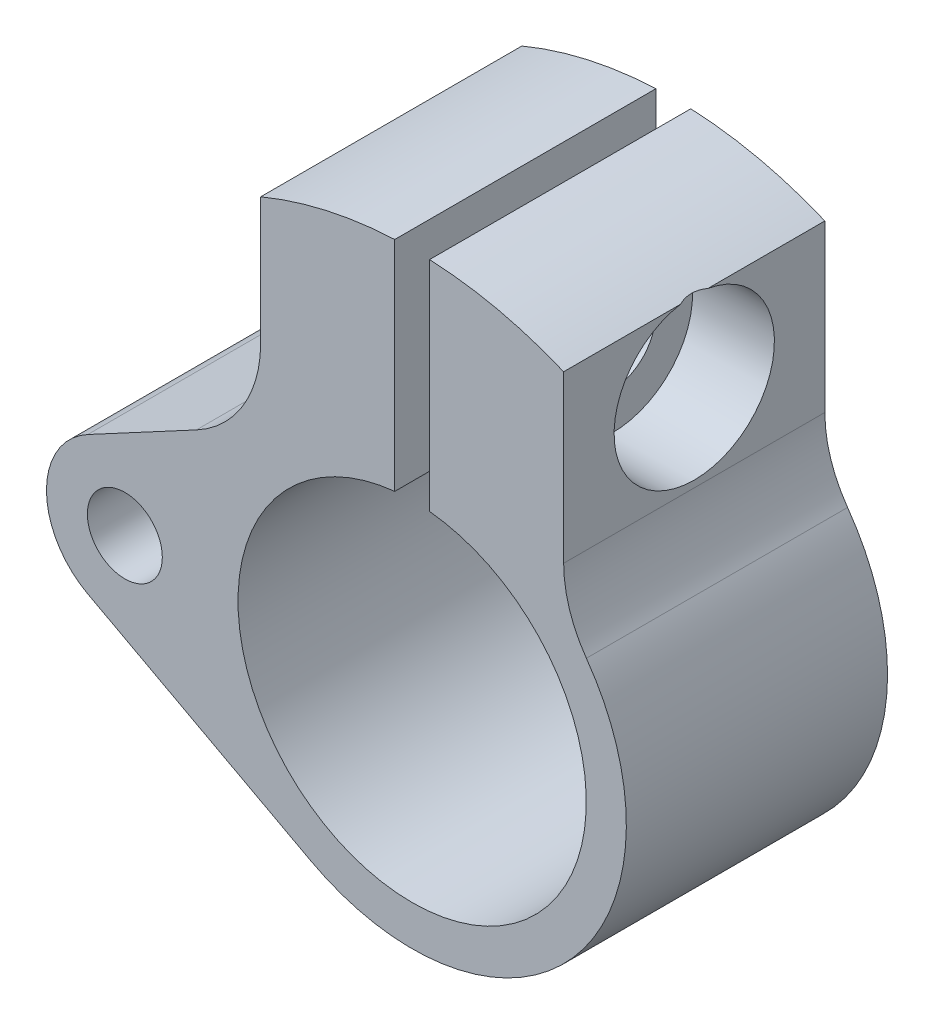
ISO-10303-21;
HEADER;
FILE_DESCRIPTION(('STEP AP214'),'2;1');
FILE_NAME('part.step','',(''),(''),'','','');
FILE_SCHEMA(('AUTOMOTIVE_DESIGN { 1 0 10303 214 1 1 1 1 }'));
ENDSEC;
DATA;
#1=APPLICATION_CONTEXT('core data for automotive mechanical design processes');
#2=APPLICATION_PROTOCOL_DEFINITION('international standard','automotive_design',2000,#1);
#3=PRODUCT_CONTEXT('',#1,'mechanical');
#4=PRODUCT('Part','Part','',(#3));
#5=PRODUCT_RELATED_PRODUCT_CATEGORY('part','',(#4));
#6=PRODUCT_DEFINITION_FORMATION('','',#4);
#7=PRODUCT_DEFINITION_CONTEXT('part definition',#1,'design');
#8=PRODUCT_DEFINITION('design','',#6,#7);
#9=PRODUCT_DEFINITION_SHAPE('','',#8);
#10=(LENGTH_UNIT() NAMED_UNIT(*) SI_UNIT(.MILLI.,.METRE.));
#11=(NAMED_UNIT(*) PLANE_ANGLE_UNIT() SI_UNIT($,.RADIAN.));
#12=(NAMED_UNIT(*) SI_UNIT($,.STERADIAN.) SOLID_ANGLE_UNIT());
#13=UNCERTAINTY_MEASURE_WITH_UNIT(LENGTH_MEASURE(1.E-05),#10,'distance_accuracy_value','');
#14=(GEOMETRIC_REPRESENTATION_CONTEXT(3) GLOBAL_UNCERTAINTY_ASSIGNED_CONTEXT((#13)) GLOBAL_UNIT_ASSIGNED_CONTEXT((#10,
#11,#12)) REPRESENTATION_CONTEXT('',''));
#15=CARTESIAN_POINT('',(0.,0.,0.));
#16=DIRECTION('',(0.,0.,1.));
#17=DIRECTION('',(1.,0.,0.));
#18=AXIS2_PLACEMENT_3D('',#15,#16,#17);
#19=CARTESIAN_POINT('',(0.,0.,7.5));
#20=DIRECTION('',(0.,0.,-1.));
#21=DIRECTION('',(-1.,0.,0.));
#22=AXIS2_PLACEMENT_3D('',#19,#20,#21);
#23=CYLINDRICAL_SURFACE('',#22,22.5);
#24=CARTESIAN_POINT('',(8.7,20.7499397589487,-0.786216811871077));
#25=CARTESIAN_POINT('',(8.67965115905921,20.7584716094591,-0.736986965830458));
#26=CARTESIAN_POINT('',(8.66087009494199,20.7663109672912,-0.686991373461257));
#27=CARTESIAN_POINT('',(8.62684034059787,20.7804707124674,-0.585538600371896));
#28=CARTESIAN_POINT('',(8.61159596948623,20.7867892428805,-0.534079717792965));
#29=CARTESIAN_POINT('',(8.57193777433177,20.8031902889029,-0.378204337120201));
#30=CARTESIAN_POINT('',(8.55343266598232,20.8107874342805,-0.271900590180851));
#31=CARTESIAN_POINT('',(8.53466987369507,20.8184901459994,-0.0566477942485051));
#32=CARTESIAN_POINT('',(8.53454278379349,20.8185420962625,0.0523146840247011));
#33=CARTESIAN_POINT('',(8.55288015816888,20.8110144377723,0.268324949278582));
#34=CARTESIAN_POINT('',(8.57133499453411,20.803438781135,0.375373698591819));
#35=CARTESIAN_POINT('',(8.61110157622291,20.7869940707316,0.53236318555092));
#36=CARTESIAN_POINT('',(8.6264206302954,20.7806450408214,0.584211327130076));
#37=CARTESIAN_POINT('',(8.66063619616065,20.7664086004096,0.686368215697202));
#38=CARTESIAN_POINT('',(8.67952447234147,20.7585247301513,0.736680202753745));
#39=CARTESIAN_POINT('',(8.7,20.7499397589487,0.786216811871079));
#40=B_SPLINE_CURVE_WITH_KNOTS('',3,(#24,#25,#26,#27,#28,#29,#30,#31,#32,#33,#34,#35,#36,#37,#38,
#39),.UNSPECIFIED.,.F.,.F.,(4,2,2,2,2,2,2,4),(0.,0.161793522249584,0.323783603547011,
0.646493792617714,0.971497045550989,1.29633199013965,1.45950504451569,1.62230609234368),.UNSPECIFIED.);
#41=CARTESIAN_POINT('',(8.7,20.7499397589487,-0.786216811871058));
#42=VERTEX_POINT('',#41);
#43=CARTESIAN_POINT('',(8.7,20.7499397589487,0.786216811871059));
#44=VERTEX_POINT('',#43);
#45=EDGE_CURVE('E47',#42,#44,#40,.T.);
#46=ORIENTED_EDGE('',*,*,#45,.F.);
#47=DIRECTION('',(0.,0.,-1.));
#48=VECTOR('',#47,1.);
#49=CARTESIAN_POINT('',(8.7,20.7499397589487,7.5));
#50=LINE('',#49,#48);
#51=CARTESIAN_POINT('',(8.7,20.7499397589487,-7.5));
#52=VERTEX_POINT('',#51);
#53=EDGE_CURVE('E138',#42,#52,#50,.T.);
#54=ORIENTED_EDGE('',*,*,#53,.T.);
#55=CARTESIAN_POINT('',(0.,0.,-7.5));
#56=DIRECTION('',(0.,0.,1.));
#57=DIRECTION('',(1.,0.,0.));
#58=AXIS2_PLACEMENT_3D('',#55,#56,#57);
#59=CIRCLE('',#58,22.5);
#60=CARTESIAN_POINT('',(1.,22.477766792989,-7.5));
#61=VERTEX_POINT('',#60);
#62=EDGE_CURVE('E213',#52,#61,#59,.T.);
#63=ORIENTED_EDGE('',*,*,#62,.T.);
#64=DIRECTION('',(0.,0.,1.));
#65=VECTOR('',#64,1.);
#66=CARTESIAN_POINT('',(1.,22.477766792989,-7.5));
#67=LINE('',#66,#65);
#68=CARTESIAN_POINT('',(1.,22.477766792989,7.5));
#69=VERTEX_POINT('',#68);
#70=EDGE_CURVE('E251',#61,#69,#67,.T.);
#71=ORIENTED_EDGE('',*,*,#70,.T.);
#72=CARTESIAN_POINT('',(0.,0.,7.5));
#73=DIRECTION('',(0.,0.,1.));
#74=DIRECTION('',(1.,0.,0.));
#75=AXIS2_PLACEMENT_3D('',#72,#73,#74);
#76=CIRCLE('',#75,22.5);
#77=CARTESIAN_POINT('',(8.7,20.7499397589487,7.5));
#78=VERTEX_POINT('',#77);
#79=EDGE_CURVE('E228',#78,#69,#76,.T.);
#80=ORIENTED_EDGE('',*,*,#79,.F.);
#81=EDGE_CURVE('E141',#78,#44,#50,.T.);
#82=ORIENTED_EDGE('',*,*,#81,.T.);
#83=EDGE_LOOP('',(#46,#54,#63,#71,#80,#82));
#84=FACE_BOUND('',#83,.T.);
#85=ADVANCED_FACE('F34',(#84),#23,.T.);
#86=CARTESIAN_POINT('',(8.7,20.7499397589487,7.5));
#87=DIRECTION('',(-1.,0.,0.));
#88=DIRECTION('',(0.,0.,1.));
#89=AXIS2_PLACEMENT_3D('',#86,#87,#88);
#90=PLANE('',#89);
#91=CARTESIAN_POINT('',(8.7,16.2138205820276,0.));
#92=DIRECTION('',(-1.,0.,0.));
#93=DIRECTION('',(0.,0.,1.));
#94=AXIS2_PLACEMENT_3D('',#91,#92,#93);
#95=CIRCLE('',#94,4.60375);
#96=EDGE_CURVE('E11',#44,#42,#95,.F.);
#97=ORIENTED_EDGE('',*,*,#96,.F.);
#98=ORIENTED_EDGE('',*,*,#81,.F.);
#99=DIRECTION('',(0.,1.,0.));
#100=VECTOR('',#99,1.);
#101=CARTESIAN_POINT('',(8.7,20.7499397589487,7.5));
#102=LINE('',#101,#100);
#103=CARTESIAN_POINT('',(8.7,11.2249721603218,7.5));
#104=VERTEX_POINT('',#103);
#105=EDGE_CURVE('E150',#104,#78,#102,.T.);
#106=ORIENTED_EDGE('',*,*,#105,.F.);
#107=DIRECTION('',(0.,0.,1.));
#108=VECTOR('',#107,1.);
#109=CARTESIAN_POINT('',(8.7,11.2249721603218,-7.5));
#110=LINE('',#109,#108);
#111=CARTESIAN_POINT('',(8.7,11.2249721603218,-7.5));
#112=VERTEX_POINT('',#111);
#113=EDGE_CURVE('E169',#104,#112,#110,.F.);
#114=ORIENTED_EDGE('',*,*,#113,.T.);
#115=DIRECTION('',(0.,1.,0.));
#116=VECTOR('',#115,1.);
#117=CARTESIAN_POINT('',(8.7,20.7499397589487,-7.5));
#118=LINE('',#117,#116);
#119=EDGE_CURVE('E148',#112,#52,#118,.T.);
#120=ORIENTED_EDGE('',*,*,#119,.T.);
#121=ORIENTED_EDGE('',*,*,#53,.F.);
#122=EDGE_LOOP('',(#97,#98,#106,#114,#120,#121));
#123=FACE_BOUND('',#122,.T.);
#124=ADVANCED_FACE('F145',(#123),#90,.F.);
#125=CARTESIAN_POINT('',(-1.,22.477766792989,7.5));
#126=VERTEX_POINT('',#125);
#127=CARTESIAN_POINT('',(-8.7,20.7499397589487,7.5));
#128=VERTEX_POINT('',#127);
#129=EDGE_CURVE('E227',#126,#128,#76,.T.);
#130=ORIENTED_EDGE('',*,*,#129,.F.);
#131=DIRECTION('',(0.,0.,1.));
#132=VECTOR('',#131,1.);
#133=CARTESIAN_POINT('',(-1.,22.477766792989,-7.5));
#134=LINE('',#133,#132);
#135=CARTESIAN_POINT('',(-1.,22.477766792989,-7.5));
#136=VERTEX_POINT('',#135);
#137=EDGE_CURVE('E252',#136,#126,#134,.T.);
#138=ORIENTED_EDGE('',*,*,#137,.F.);
#139=CARTESIAN_POINT('',(-8.7,20.7499397589487,-7.5));
#140=VERTEX_POINT('',#139);
#141=EDGE_CURVE('E217',#136,#140,#59,.T.);
#142=ORIENTED_EDGE('',*,*,#141,.T.);
#143=DIRECTION('',(0.,0.,-1.));
#144=VECTOR('',#143,1.);
#145=CARTESIAN_POINT('',(-8.7,20.7499397589487,7.5));
#146=LINE('',#145,#144);
#147=EDGE_CURVE('E166',#128,#140,#146,.T.);
#148=ORIENTED_EDGE('',*,*,#147,.F.);
#149=EDGE_LOOP('',(#130,#138,#142,#148));
#150=FACE_BOUND('',#149,.T.);
#151=ADVANCED_FACE('F303',(#150),#23,.T.);
#152=CARTESIAN_POINT('',(0.,0.,7.5));
#153=DIRECTION('',(0.,0.,1.));
#154=DIRECTION('',(1.,0.,0.));
#155=AXIS2_PLACEMENT_3D('',#152,#153,#154);
#156=PLANE('',#155);
#157=CARTESIAN_POINT('',(-16.5,0.,7.5));
#158=DIRECTION('',(0.,0.,1.));
#159=DIRECTION('',(1.,0.,0.));
#160=AXIS2_PLACEMENT_3D('',#157,#158,#159);
#161=CIRCLE('',#160,2.15264999999999);
#162=CARTESIAN_POINT('',(-14.34735,0.,7.5));
#163=VERTEX_POINT('',#162);
#164=EDGE_CURVE('E483',#163,#163,#161,.T.);
#165=ORIENTED_EDGE('',*,*,#164,.F.);
#166=EDGE_LOOP('',(#165));
#167=FACE_BOUND('',#166,.T.);
#168=DIRECTION('',(0.,-1.,0.));
#169=VECTOR('',#168,1.);
#170=CARTESIAN_POINT('',(-1.,22.477766792989,7.5));
#171=LINE('',#170,#169);
#172=CARTESIAN_POINT('',(-0.999999999999999,9.9498743710662,7.5));
#173=VERTEX_POINT('',#172);
#174=EDGE_CURVE('E259',#126,#173,#171,.T.);
#175=ORIENTED_EDGE('',*,*,#174,.F.);
#176=ORIENTED_EDGE('',*,*,#129,.T.);
#177=DIRECTION('',(0.,-1.,0.));
#178=VECTOR('',#177,1.);
#179=CARTESIAN_POINT('',(-8.7,20.7499397589487,7.5));
#180=LINE('',#179,#178);
#181=CARTESIAN_POINT('',(-8.7,13.4794182701187,7.5));
#182=VERTEX_POINT('',#181);
#183=EDGE_CURVE('E192',#128,#182,#180,.T.);
#184=ORIENTED_EDGE('',*,*,#183,.T.);
#185=CARTESIAN_POINT('',(-15.7,13.4794182701187,7.5));
#186=DIRECTION('',(0.,0.,1.));
#187=DIRECTION('',(1.,0.,0.));
#188=AXIS2_PLACEMENT_3D('',#185,#186,#187);
#189=CIRCLE('',#188,7.);
#190=CARTESIAN_POINT('',(-12.3909090909091,7.3109567637646,7.5));
#191=VERTEX_POINT('',#190);
#192=EDGE_CURVE('E42',#182,#191,#189,.F.);
#193=ORIENTED_EDGE('',*,*,#192,.T.);
#194=DIRECTION('',(-0.88120878662201,-0.472727272727273,0.));
#195=VECTOR('',#194,1.);
#196=CARTESIAN_POINT('',(-18.6272727272727,3.96543953979904,7.5));
#197=LINE('',#196,#195);
#198=CARTESIAN_POINT('',(-18.6272727272727,3.96543953979904,7.5));
#199=VERTEX_POINT('',#198);
#200=EDGE_CURVE('E189',#191,#199,#197,.T.);
#201=ORIENTED_EDGE('',*,*,#200,.T.);
#202=CARTESIAN_POINT('',(-16.5,0.,7.5));
#203=DIRECTION('',(0.,0.,1.));
#204=DIRECTION('',(1.,0.,0.));
#205=AXIS2_PLACEMENT_3D('',#202,#203,#204);
#206=CIRCLE('',#205,4.5);
#207=CARTESIAN_POINT('',(-18.6272727272727,-3.96543953979905,7.5));
#208=VERTEX_POINT('',#207);
#209=EDGE_CURVE('E200',#199,#208,#206,.T.);
#210=ORIENTED_EDGE('',*,*,#209,.T.);
#211=DIRECTION('',(0.88120878662201,-0.472727272727272,0.));
#212=VECTOR('',#211,1.);
#213=CARTESIAN_POINT('',(-18.6272727272727,-3.96543953979905,7.5));
#214=LINE('',#213,#212);
#215=CARTESIAN_POINT('',(-5.81454545454546,-10.8388680754507,7.5));
#216=VERTEX_POINT('',#215);
#217=EDGE_CURVE('E238',#208,#216,#214,.T.);
#218=ORIENTED_EDGE('',*,*,#217,.T.);
#219=CARTESIAN_POINT('',(0.,0.,7.5));
#220=DIRECTION('',(0.,0.,1.));
#221=DIRECTION('',(1.,0.,0.));
#222=AXIS2_PLACEMENT_3D('',#219,#220,#221);
#223=CIRCLE('',#222,12.3);
#224=CARTESIAN_POINT('',(10.0056994818653,7.15373873429836,7.5));
#225=VERTEX_POINT('',#224);
#226=EDGE_CURVE('E153',#216,#225,#223,.T.);
#227=ORIENTED_EDGE('',*,*,#226,.T.);
#228=CARTESIAN_POINT('',(15.7,11.2249721603218,7.5));
#229=DIRECTION('',(0.,0.,1.));
#230=DIRECTION('',(1.,0.,0.));
#231=AXIS2_PLACEMENT_3D('',#228,#229,#230);
#232=CIRCLE('',#231,7.);
#233=EDGE_CURVE('E180',#225,#104,#232,.F.);
#234=ORIENTED_EDGE('',*,*,#233,.T.);
#235=ORIENTED_EDGE('',*,*,#105,.T.);
#236=ORIENTED_EDGE('',*,*,#79,.T.);
#237=DIRECTION('',(0.,1.,0.));
#238=VECTOR('',#237,1.);
#239=CARTESIAN_POINT('',(1.,22.477766792989,7.5));
#240=LINE('',#239,#238);
#241=CARTESIAN_POINT('',(0.999999999999999,9.9498743710662,7.5));
#242=VERTEX_POINT('',#241);
#243=EDGE_CURVE('E142',#242,#69,#240,.T.);
#244=ORIENTED_EDGE('',*,*,#243,.F.);
#245=CARTESIAN_POINT('',(0.,0.,7.5));
#246=DIRECTION('',(0.,0.,1.));
#247=DIRECTION('',(1.,0.,0.));
#248=AXIS2_PLACEMENT_3D('',#245,#246,#247);
#249=CIRCLE('',#248,10.);
#250=EDGE_CURVE('E258',#173,#242,#249,.T.);
#251=ORIENTED_EDGE('',*,*,#250,.F.);
#252=EDGE_LOOP('',(#175,#176,#184,#193,#201,#210,#218,#227,#234,#235,#236,#244,#251));
#253=FACE_BOUND('',#252,.T.);
#254=ADVANCED_FACE('F188',(#167,#253),#156,.T.);
#255=CARTESIAN_POINT('',(0.,0.,-7.5));
#256=DIRECTION('',(0.,0.,1.));
#257=DIRECTION('',(1.,0.,0.));
#258=AXIS2_PLACEMENT_3D('',#255,#256,#257);
#259=PLANE('',#258);
#260=CARTESIAN_POINT('',(-16.5,0.,-7.5));
#261=DIRECTION('',(0.,0.,1.));
#262=DIRECTION('',(1.,0.,0.));
#263=AXIS2_PLACEMENT_3D('',#260,#261,#262);
#264=CIRCLE('',#263,2.15264999999999);
#265=CARTESIAN_POINT('',(-14.34735,0.,-7.5));
#266=VERTEX_POINT('',#265);
#267=EDGE_CURVE('E480',#266,#266,#264,.T.);
#268=ORIENTED_EDGE('',*,*,#267,.T.);
#269=EDGE_LOOP('',(#268));
#270=FACE_BOUND('',#269,.T.);
#271=ORIENTED_EDGE('',*,*,#141,.F.);
#272=DIRECTION('',(0.,-1.,0.));
#273=VECTOR('',#272,1.);
#274=CARTESIAN_POINT('',(-1.,22.477766792989,-7.5));
#275=LINE('',#274,#273);
#276=CARTESIAN_POINT('',(-0.999999999999999,9.9498743710662,-7.5));
#277=VERTEX_POINT('',#276);
#278=EDGE_CURVE('E267',#136,#277,#275,.T.);
#279=ORIENTED_EDGE('',*,*,#278,.T.);
#280=CARTESIAN_POINT('',(0.,0.,-7.5));
#281=DIRECTION('',(0.,0.,1.));
#282=DIRECTION('',(1.,0.,0.));
#283=AXIS2_PLACEMENT_3D('',#280,#281,#282);
#284=CIRCLE('',#283,10.);
#285=CARTESIAN_POINT('',(0.999999999999999,9.9498743710662,-7.5));
#286=VERTEX_POINT('',#285);
#287=EDGE_CURVE('E234',#277,#286,#284,.T.);
#288=ORIENTED_EDGE('',*,*,#287,.T.);
#289=DIRECTION('',(0.,1.,0.));
#290=VECTOR('',#289,1.);
#291=CARTESIAN_POINT('',(1.,22.477766792989,-7.5));
#292=LINE('',#291,#290);
#293=EDGE_CURVE('E55',#286,#61,#292,.T.);
#294=ORIENTED_EDGE('',*,*,#293,.T.);
#295=ORIENTED_EDGE('',*,*,#62,.F.);
#296=ORIENTED_EDGE('',*,*,#119,.F.);
#297=CARTESIAN_POINT('',(15.7,11.2249721603218,-7.5));
#298=DIRECTION('',(0.,0.,1.));
#299=DIRECTION('',(1.,0.,0.));
#300=AXIS2_PLACEMENT_3D('',#297,#298,#299);
#301=CIRCLE('',#300,7.);
#302=CARTESIAN_POINT('',(10.0056994818653,7.15373873429836,-7.5));
#303=VERTEX_POINT('',#302);
#304=EDGE_CURVE('E178',#112,#303,#301,.T.);
#305=ORIENTED_EDGE('',*,*,#304,.T.);
#306=CARTESIAN_POINT('',(0.,0.,-7.5));
#307=DIRECTION('',(0.,0.,1.));
#308=DIRECTION('',(1.,0.,0.));
#309=AXIS2_PLACEMENT_3D('',#306,#307,#308);
#310=CIRCLE('',#309,12.3);
#311=CARTESIAN_POINT('',(-5.81454545454546,-10.8388680754507,-7.5));
#312=VERTEX_POINT('',#311);
#313=EDGE_CURVE('E222',#312,#303,#310,.T.);
#314=ORIENTED_EDGE('',*,*,#313,.F.);
#315=DIRECTION('',(0.88120878662201,-0.472727272727272,0.));
#316=VECTOR('',#315,1.);
#317=CARTESIAN_POINT('',(-18.6272727272727,-3.96543953979905,-7.5));
#318=LINE('',#317,#316);
#319=CARTESIAN_POINT('',(-18.6272727272727,-3.96543953979905,-7.5));
#320=VERTEX_POINT('',#319);
#321=EDGE_CURVE('E221',#320,#312,#318,.T.);
#322=ORIENTED_EDGE('',*,*,#321,.F.);
#323=CARTESIAN_POINT('',(-16.5,0.,-7.5));
#324=DIRECTION('',(0.,0.,1.));
#325=DIRECTION('',(1.,0.,0.));
#326=AXIS2_PLACEMENT_3D('',#323,#324,#325);
#327=CIRCLE('',#326,4.5);
#328=CARTESIAN_POINT('',(-18.6272727272727,3.96543953979904,-7.5));
#329=VERTEX_POINT('',#328);
#330=EDGE_CURVE('E215',#329,#320,#327,.T.);
#331=ORIENTED_EDGE('',*,*,#330,.F.);
#332=DIRECTION('',(-0.88120878662201,-0.472727272727273,0.));
#333=VECTOR('',#332,1.);
#334=CARTESIAN_POINT('',(-18.6272727272727,3.96543953979904,-7.5));
#335=LINE('',#334,#333);
#336=CARTESIAN_POINT('',(-12.3909090909091,7.3109567637646,-7.5));
#337=VERTEX_POINT('',#336);
#338=EDGE_CURVE('E209',#337,#329,#335,.T.);
#339=ORIENTED_EDGE('',*,*,#338,.F.);
#340=CARTESIAN_POINT('',(-15.7,13.4794182701187,-7.5));
#341=DIRECTION('',(0.,0.,1.));
#342=DIRECTION('',(1.,0.,0.));
#343=AXIS2_PLACEMENT_3D('',#340,#341,#342);
#344=CIRCLE('',#343,7.);
#345=CARTESIAN_POINT('',(-8.7,13.4794182701187,-7.5));
#346=VERTEX_POINT('',#345);
#347=EDGE_CURVE('E182',#337,#346,#344,.T.);
#348=ORIENTED_EDGE('',*,*,#347,.T.);
#349=DIRECTION('',(0.,-1.,0.));
#350=VECTOR('',#349,1.);
#351=CARTESIAN_POINT('',(-8.7,20.7499397589487,-7.5));
#352=LINE('',#351,#350);
#353=EDGE_CURVE('E207',#140,#346,#352,.T.);
#354=ORIENTED_EDGE('',*,*,#353,.F.);
#355=EDGE_LOOP('',(#271,#279,#288,#294,#295,#296,#305,#314,#322,#331,#339,#348,#354));
#356=FACE_BOUND('',#355,.T.);
#357=ADVANCED_FACE('F206',(#270,#356),#259,.F.);
#358=CARTESIAN_POINT('',(-8.7,20.7499397589487,7.5));
#359=DIRECTION('',(1.,0.,0.));
#360=DIRECTION('',(0.,1.,0.));
#361=AXIS2_PLACEMENT_3D('',#358,#359,#360);
#362=PLANE('',#361);
#363=CARTESIAN_POINT('',(-8.7,16.2138205820276,0.));
#364=DIRECTION('',(1.,0.,0.));
#365=DIRECTION('',(0.,1.,0.));
#366=AXIS2_PLACEMENT_3D('',#363,#364,#365);
#367=CIRCLE('',#366,1.72719999999999);
#368=CARTESIAN_POINT('',(-8.7,17.9410205820276,0.));
#369=VERTEX_POINT('',#368);
#370=EDGE_CURVE('E473',#369,#369,#367,.T.);
#371=ORIENTED_EDGE('',*,*,#370,.T.);
#372=EDGE_LOOP('',(#371));
#373=FACE_BOUND('',#372,.T.);
#374=ORIENTED_EDGE('',*,*,#353,.T.);
#375=DIRECTION('',(0.,0.,-1.));
#376=VECTOR('',#375,1.);
#377=CARTESIAN_POINT('',(-8.7,13.4794182701187,7.5));
#378=LINE('',#377,#376);
#379=EDGE_CURVE('E176',#346,#182,#378,.F.);
#380=ORIENTED_EDGE('',*,*,#379,.T.);
#381=ORIENTED_EDGE('',*,*,#183,.F.);
#382=ORIENTED_EDGE('',*,*,#147,.T.);
#383=EDGE_LOOP('',(#374,#380,#381,#382));
#384=FACE_BOUND('',#383,.T.);
#385=ADVANCED_FACE('F211',(#373,#384),#362,.F.);
#386=CARTESIAN_POINT('',(-18.6272727272727,3.96543953979904,7.5));
#387=DIRECTION('',(0.472727272727273,-0.88120878662201,0.));
#388=DIRECTION('',(0.88120878662201,0.472727272727273,0.));
#389=AXIS2_PLACEMENT_3D('',#386,#387,#388);
#390=PLANE('',#389);
#391=ORIENTED_EDGE('',*,*,#200,.F.);
#392=DIRECTION('',(0.,0.,-1.));
#393=VECTOR('',#392,1.);
#394=CARTESIAN_POINT('',(-12.3909090909091,7.3109567637646,-7.5));
#395=LINE('',#394,#393);
#396=EDGE_CURVE('E173',#191,#337,#395,.T.);
#397=ORIENTED_EDGE('',*,*,#396,.T.);
#398=ORIENTED_EDGE('',*,*,#338,.T.);
#399=DIRECTION('',(0.,0.,-1.));
#400=VECTOR('',#399,1.);
#401=CARTESIAN_POINT('',(-18.6272727272727,3.96543953979904,7.5));
#402=LINE('',#401,#400);
#403=EDGE_CURVE('E163',#199,#329,#402,.T.);
#404=ORIENTED_EDGE('',*,*,#403,.F.);
#405=EDGE_LOOP('',(#391,#397,#398,#404));
#406=FACE_BOUND('',#405,.T.);
#407=ADVANCED_FACE('F197',(#406),#390,.F.);
#408=CARTESIAN_POINT('',(-16.5,0.,7.5));
#409=DIRECTION('',(0.,0.,-1.));
#410=DIRECTION('',(-1.,0.,0.));
#411=AXIS2_PLACEMENT_3D('',#408,#409,#410);
#412=CYLINDRICAL_SURFACE('',#411,4.5);
#413=ORIENTED_EDGE('',*,*,#330,.T.);
#414=DIRECTION('',(0.,0.,-1.));
#415=VECTOR('',#414,1.);
#416=CARTESIAN_POINT('',(-18.6272727272727,-3.96543953979905,7.5));
#417=LINE('',#416,#415);
#418=EDGE_CURVE('E160',#208,#320,#417,.T.);
#419=ORIENTED_EDGE('',*,*,#418,.F.);
#420=ORIENTED_EDGE('',*,*,#209,.F.);
#421=ORIENTED_EDGE('',*,*,#403,.T.);
#422=EDGE_LOOP('',(#413,#419,#420,#421));
#423=FACE_BOUND('',#422,.T.);
#424=ADVANCED_FACE('F315',(#423),#412,.T.);
#425=CARTESIAN_POINT('',(-18.6272727272727,-3.96543953979905,7.5));
#426=DIRECTION('',(0.472727272727272,0.88120878662201,0.));
#427=DIRECTION('',(-0.88120878662201,0.472727272727272,0.));
#428=AXIS2_PLACEMENT_3D('',#425,#426,#427);
#429=PLANE('',#428);
#430=ORIENTED_EDGE('',*,*,#321,.T.);
#431=DIRECTION('',(0.,0.,-1.));
#432=VECTOR('',#431,1.);
#433=CARTESIAN_POINT('',(-5.81454545454546,-10.8388680754507,7.5));
#434=LINE('',#433,#432);
#435=EDGE_CURVE('E152',#216,#312,#434,.T.);
#436=ORIENTED_EDGE('',*,*,#435,.F.);
#437=ORIENTED_EDGE('',*,*,#217,.F.);
#438=ORIENTED_EDGE('',*,*,#418,.T.);
#439=EDGE_LOOP('',(#430,#436,#437,#438));
#440=FACE_BOUND('',#439,.T.);
#441=ADVANCED_FACE('F312',(#440),#429,.F.);
#442=CARTESIAN_POINT('',(0.,0.,7.5));
#443=DIRECTION('',(0.,0.,-1.));
#444=DIRECTION('',(-1.,0.,0.));
#445=AXIS2_PLACEMENT_3D('',#442,#443,#444);
#446=CYLINDRICAL_SURFACE('',#445,12.3);
#447=ORIENTED_EDGE('',*,*,#313,.T.);
#448=DIRECTION('',(0.,0.,-1.));
#449=VECTOR('',#448,1.);
#450=CARTESIAN_POINT('',(10.0056994818653,7.15373873429836,7.5));
#451=LINE('',#450,#449);
#452=EDGE_CURVE('E171',#303,#225,#451,.F.);
#453=ORIENTED_EDGE('',*,*,#452,.T.);
#454=ORIENTED_EDGE('',*,*,#226,.F.);
#455=ORIENTED_EDGE('',*,*,#435,.T.);
#456=EDGE_LOOP('',(#447,#453,#454,#455));
#457=FACE_BOUND('',#456,.T.);
#458=ADVANCED_FACE('F300',(#457),#446,.T.);
#459=CARTESIAN_POINT('',(0.,0.,7.5));
#460=DIRECTION('',(0.,0.,-1.));
#461=DIRECTION('',(-1.,0.,0.));
#462=AXIS2_PLACEMENT_3D('',#459,#460,#461);
#463=CYLINDRICAL_SURFACE('',#462,10.);
#464=DIRECTION('',(0.,0.,1.));
#465=VECTOR('',#464,1.);
#466=CARTESIAN_POINT('',(-0.999999999999999,9.9498743710662,-7.5));
#467=LINE('',#466,#465);
#468=EDGE_CURVE('E265',#277,#173,#467,.T.);
#469=ORIENTED_EDGE('',*,*,#468,.T.);
#470=ORIENTED_EDGE('',*,*,#250,.T.);
#471=DIRECTION('',(0.,0.,1.));
#472=VECTOR('',#471,1.);
#473=CARTESIAN_POINT('',(0.999999999999999,9.9498743710662,-7.5));
#474=LINE('',#473,#472);
#475=EDGE_CURVE('E253',#286,#242,#474,.T.);
#476=ORIENTED_EDGE('',*,*,#475,.F.);
#477=ORIENTED_EDGE('',*,*,#287,.F.);
#478=EDGE_LOOP('',(#469,#470,#476,#477));
#479=FACE_BOUND('',#478,.T.);
#480=ADVANCED_FACE('F263',(#479),#463,.F.);
#481=CARTESIAN_POINT('',(15.7,11.2249721603218,7.5));
#482=DIRECTION('',(0.,0.,-1.));
#483=DIRECTION('',(-1.,0.,0.));
#484=AXIS2_PLACEMENT_3D('',#481,#482,#483);
#485=CYLINDRICAL_SURFACE('',#484,7.);
#486=ORIENTED_EDGE('',*,*,#233,.F.);
#487=ORIENTED_EDGE('',*,*,#452,.F.);
#488=ORIENTED_EDGE('',*,*,#304,.F.);
#489=ORIENTED_EDGE('',*,*,#113,.F.);
#490=EDGE_LOOP('',(#486,#487,#488,#489));
#491=FACE_BOUND('',#490,.T.);
#492=ADVANCED_FACE('F248',(#491),#485,.F.);
#493=CARTESIAN_POINT('',(-15.7,13.4794182701187,7.5));
#494=DIRECTION('',(0.,0.,1.));
#495=DIRECTION('',(1.,0.,0.));
#496=AXIS2_PLACEMENT_3D('',#493,#494,#495);
#497=CYLINDRICAL_SURFACE('',#496,7.);
#498=ORIENTED_EDGE('',*,*,#192,.F.);
#499=ORIENTED_EDGE('',*,*,#379,.F.);
#500=ORIENTED_EDGE('',*,*,#347,.F.);
#501=ORIENTED_EDGE('',*,*,#396,.F.);
#502=EDGE_LOOP('',(#498,#499,#500,#501));
#503=FACE_BOUND('',#502,.T.);
#504=ADVANCED_FACE('F36',(#503),#497,.F.);
#505=CARTESIAN_POINT('',(1.,22.477766792989,-7.5));
#506=DIRECTION('',(1.,0.,0.));
#507=DIRECTION('',(0.,1.,0.));
#508=AXIS2_PLACEMENT_3D('',#505,#506,#507);
#509=PLANE('',#508);
#510=CARTESIAN_POINT('',(0.999999999999999,16.2138205820276,0.));
#511=DIRECTION('',(1.,0.,0.));
#512=DIRECTION('',(0.,1.,0.));
#513=AXIS2_PLACEMENT_3D('',#510,#511,#512);
#514=CIRCLE('',#513,2.45744999999999);
#515=CARTESIAN_POINT('',(0.999999999999999,18.6712705820276,0.));
#516=VERTEX_POINT('',#515);
#517=EDGE_CURVE('E470',#516,#516,#514,.T.);
#518=ORIENTED_EDGE('',*,*,#517,.T.);
#519=EDGE_LOOP('',(#518));
#520=FACE_BOUND('',#519,.T.);
#521=ORIENTED_EDGE('',*,*,#243,.T.);
#522=ORIENTED_EDGE('',*,*,#70,.F.);
#523=ORIENTED_EDGE('',*,*,#293,.F.);
#524=ORIENTED_EDGE('',*,*,#475,.T.);
#525=EDGE_LOOP('',(#521,#522,#523,#524));
#526=FACE_BOUND('',#525,.T.);
#527=ADVANCED_FACE('F293',(#520,#526),#509,.F.);
#528=CARTESIAN_POINT('',(-1.,22.477766792989,-7.5));
#529=DIRECTION('',(-1.,0.,0.));
#530=DIRECTION('',(0.,-1.,0.));
#531=AXIS2_PLACEMENT_3D('',#528,#529,#530);
#532=PLANE('',#531);
#533=CARTESIAN_POINT('',(-1.,16.2138205820276,0.));
#534=DIRECTION('',(1.,0.,0.));
#535=DIRECTION('',(0.,0.,-1.));
#536=AXIS2_PLACEMENT_3D('',#533,#534,#535);
#537=CIRCLE('',#536,1.72719999999999);
#538=CARTESIAN_POINT('',(-1.,16.2138205820276,-1.72719999999999));
#539=VERTEX_POINT('',#538);
#540=EDGE_CURVE('E477',#539,#539,#537,.T.);
#541=ORIENTED_EDGE('',*,*,#540,.F.);
#542=EDGE_LOOP('',(#541));
#543=FACE_BOUND('',#542,.T.);
#544=ORIENTED_EDGE('',*,*,#174,.T.);
#545=ORIENTED_EDGE('',*,*,#468,.F.);
#546=ORIENTED_EDGE('',*,*,#278,.F.);
#547=ORIENTED_EDGE('',*,*,#137,.T.);
#548=EDGE_LOOP('',(#544,#545,#546,#547));
#549=FACE_BOUND('',#548,.T.);
#550=ADVANCED_FACE('F288',(#543,#549),#532,.F.);
#551=CARTESIAN_POINT('',(19.,16.2138205820276,0.));
#552=DIRECTION('',(-1.,0.,0.));
#553=DIRECTION('',(0.,-1.,0.));
#554=AXIS2_PLACEMENT_3D('',#551,#552,#553);
#555=CYLINDRICAL_SURFACE('',#554,4.60375);
#556=CARTESIAN_POINT('',(4.,16.2138205820276,0.));
#557=DIRECTION('',(1.,0.,0.));
#558=DIRECTION('',(0.,1.,0.));
#559=AXIS2_PLACEMENT_3D('',#556,#557,#558);
#560=CIRCLE('',#559,4.60375);
#561=CARTESIAN_POINT('',(4.,20.8175705820276,0.));
#562=VERTEX_POINT('',#561);
#563=EDGE_CURVE('E143',#562,#562,#560,.T.);
#564=ORIENTED_EDGE('',*,*,#563,.F.);
#565=EDGE_LOOP('',(#564));
#566=FACE_BOUND('',#565,.T.);
#567=ORIENTED_EDGE('',*,*,#45,.T.);
#568=ORIENTED_EDGE('',*,*,#96,.T.);
#569=EDGE_LOOP('',(#567,#568));
#570=FACE_BOUND('',#569,.T.);
#571=ADVANCED_FACE('F131',(#566,#570),#555,.F.);
#572=CARTESIAN_POINT('',(4.,16.2138205820276,0.));
#573=DIRECTION('',(1.,0.,0.));
#574=DIRECTION('',(0.,1.,0.));
#575=AXIS2_PLACEMENT_3D('',#572,#573,#574);
#576=PLANE('',#575);
#577=CARTESIAN_POINT('',(4.,16.2138205820276,0.));
#578=DIRECTION('',(1.,0.,0.));
#579=DIRECTION('',(0.,0.,-1.));
#580=AXIS2_PLACEMENT_3D('',#577,#578,#579);
#581=CIRCLE('',#580,2.45744999999999);
#582=CARTESIAN_POINT('',(4.,16.2138205820276,-2.45744999999999));
#583=VERTEX_POINT('',#582);
#584=EDGE_CURVE('E467',#583,#583,#581,.T.);
#585=ORIENTED_EDGE('',*,*,#584,.F.);
#586=EDGE_LOOP('',(#585));
#587=FACE_BOUND('',#586,.T.);
#588=ORIENTED_EDGE('',*,*,#563,.T.);
#589=EDGE_LOOP('',(#588));
#590=FACE_BOUND('',#589,.T.);
#591=ADVANCED_FACE('F287',(#587,#590),#576,.T.);
#592=CARTESIAN_POINT('',(4.,16.2138205820276,0.));
#593=DIRECTION('',(1.,0.,0.));
#594=DIRECTION('',(0.,0.,-1.));
#595=AXIS2_PLACEMENT_3D('',#592,#593,#594);
#596=CYLINDRICAL_SURFACE('',#595,2.45744999999999);
#597=ORIENTED_EDGE('',*,*,#517,.F.);
#598=EDGE_LOOP('',(#597));
#599=FACE_BOUND('',#598,.T.);
#600=ORIENTED_EDGE('',*,*,#584,.T.);
#601=EDGE_LOOP('',(#600));
#602=FACE_BOUND('',#601,.T.);
#603=ADVANCED_FACE('F369',(#599,#602),#596,.F.);
#604=CARTESIAN_POINT('',(-1.,16.2138205820276,0.));
#605=DIRECTION('',(1.,0.,0.));
#606=DIRECTION('',(0.,0.,-1.));
#607=AXIS2_PLACEMENT_3D('',#604,#605,#606);
#608=CYLINDRICAL_SURFACE('',#607,1.72719999999999);
#609=ORIENTED_EDGE('',*,*,#540,.T.);
#610=EDGE_LOOP('',(#609));
#611=FACE_BOUND('',#610,.T.);
#612=ORIENTED_EDGE('',*,*,#370,.F.);
#613=EDGE_LOOP('',(#612));
#614=FACE_BOUND('',#613,.T.);
#615=ADVANCED_FACE('F358',(#611,#614),#608,.F.);
#616=CARTESIAN_POINT('',(-16.5,0.,7.5));
#617=DIRECTION('',(0.,0.,1.));
#618=DIRECTION('',(1.,0.,0.));
#619=AXIS2_PLACEMENT_3D('',#616,#617,#618);
#620=CYLINDRICAL_SURFACE('',#619,2.15264999999999);
#621=ORIENTED_EDGE('',*,*,#267,.F.);
#622=EDGE_LOOP('',(#621));
#623=FACE_BOUND('',#622,.T.);
#624=ORIENTED_EDGE('',*,*,#164,.T.);
#625=EDGE_LOOP('',(#624));
#626=FACE_BOUND('',#625,.T.);
#627=ADVANCED_FACE('F354',(#623,#626),#620,.F.);
#628=CLOSED_SHELL('',(#85,#124,#151,#254,#357,#385,#407,#424,#441,#458,#480,#492,#504,#527,#550,
#571,#591,#603,#615,#627));
#629=MANIFOLD_SOLID_BREP('B2',#628);
#630=ADVANCED_BREP_SHAPE_REPRESENTATION('',(#18,#629),#14);
#631=SHAPE_DEFINITION_REPRESENTATION(#9,#630);
ENDSEC;
END-ISO-10303-21;
